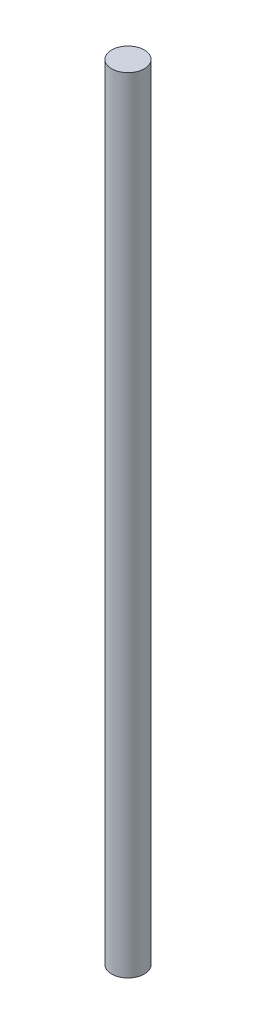
ISO-10303-21;
HEADER;
FILE_DESCRIPTION(('STEP AP214'),'2;1');
FILE_NAME('part.step','',(''),(''),'','','');
FILE_SCHEMA(('AUTOMOTIVE_DESIGN { 1 0 10303 214 1 1 1 1 }'));
ENDSEC;
DATA;
#1=APPLICATION_CONTEXT('core data for automotive mechanical design processes');
#2=APPLICATION_PROTOCOL_DEFINITION('international standard','automotive_design',2000,#1);
#3=PRODUCT_CONTEXT('',#1,'mechanical');
#4=PRODUCT('Part','Part','',(#3));
#5=PRODUCT_RELATED_PRODUCT_CATEGORY('part','',(#4));
#6=PRODUCT_DEFINITION_FORMATION('','',#4);
#7=PRODUCT_DEFINITION_CONTEXT('part definition',#1,'design');
#8=PRODUCT_DEFINITION('design','',#6,#7);
#9=PRODUCT_DEFINITION_SHAPE('','',#8);
#10=(LENGTH_UNIT() NAMED_UNIT(*) SI_UNIT(.MILLI.,.METRE.));
#11=(NAMED_UNIT(*) PLANE_ANGLE_UNIT() SI_UNIT($,.RADIAN.));
#12=(NAMED_UNIT(*) SI_UNIT($,.STERADIAN.) SOLID_ANGLE_UNIT());
#13=UNCERTAINTY_MEASURE_WITH_UNIT(LENGTH_MEASURE(1.E-05),#10,'distance_accuracy_value','');
#14=(GEOMETRIC_REPRESENTATION_CONTEXT(3) GLOBAL_UNCERTAINTY_ASSIGNED_CONTEXT((#13)) GLOBAL_UNIT_ASSIGNED_CONTEXT((#10,
#11,#12)) REPRESENTATION_CONTEXT('',''));
#15=CARTESIAN_POINT('',(0.,0.,0.));
#16=DIRECTION('',(0.,0.,1.));
#17=DIRECTION('',(1.,0.,0.));
#18=AXIS2_PLACEMENT_3D('',#15,#16,#17);
#19=CARTESIAN_POINT('',(0.,609.6,0.));
#20=DIRECTION('',(0.,-1.,0.));
#21=DIRECTION('',(0.,0.,-1.));
#22=AXIS2_PLACEMENT_3D('',#19,#20,#21);
#23=CYLINDRICAL_SURFACE('',#22,12.7);
#24=CARTESIAN_POINT('',(0.,609.6,0.));
#25=DIRECTION('',(0.,1.,0.));
#26=DIRECTION('',(0.,0.,1.));
#27=AXIS2_PLACEMENT_3D('',#24,#25,#26);
#28=CIRCLE('',#27,12.7);
#29=CARTESIAN_POINT('',(0.,609.6,12.7));
#30=VERTEX_POINT('',#29);
#31=EDGE_CURVE('E10',#30,#30,#28,.T.);
#32=ORIENTED_EDGE('',*,*,#31,.F.);
#33=EDGE_LOOP('',(#32));
#34=FACE_BOUND('',#33,.T.);
#35=CARTESIAN_POINT('',(0.,0.,0.));
#36=DIRECTION('',(0.,1.,0.));
#37=DIRECTION('',(0.,0.,1.));
#38=AXIS2_PLACEMENT_3D('',#35,#36,#37);
#39=CIRCLE('',#38,12.7);
#40=CARTESIAN_POINT('',(0.,0.,12.7));
#41=VERTEX_POINT('',#40);
#42=EDGE_CURVE('E35',#41,#41,#39,.T.);
#43=ORIENTED_EDGE('',*,*,#42,.T.);
#44=EDGE_LOOP('',(#43));
#45=FACE_BOUND('',#44,.T.);
#46=ADVANCED_FACE('F32',(#34,#45),#23,.T.);
#47=CARTESIAN_POINT('',(0.,609.6,0.));
#48=DIRECTION('',(0.,1.,0.));
#49=DIRECTION('',(0.,0.,1.));
#50=AXIS2_PLACEMENT_3D('',#47,#48,#49);
#51=PLANE('',#50);
#52=ORIENTED_EDGE('',*,*,#31,.T.);
#53=EDGE_LOOP('',(#52));
#54=FACE_BOUND('',#53,.T.);
#55=ADVANCED_FACE('F47',(#54),#51,.T.);
#56=CARTESIAN_POINT('',(0.,0.,0.));
#57=DIRECTION('',(0.,1.,0.));
#58=DIRECTION('',(0.,0.,1.));
#59=AXIS2_PLACEMENT_3D('',#56,#57,#58);
#60=PLANE('',#59);
#61=ORIENTED_EDGE('',*,*,#42,.F.);
#62=EDGE_LOOP('',(#61));
#63=FACE_BOUND('',#62,.T.);
#64=ADVANCED_FACE('F45',(#63),#60,.F.);
#65=CLOSED_SHELL('',(#46,#55,#64));
#66=MANIFOLD_SOLID_BREP('B2',#65);
#67=ADVANCED_BREP_SHAPE_REPRESENTATION('',(#18,#66),#14);
#68=SHAPE_DEFINITION_REPRESENTATION(#9,#67);
ENDSEC;
END-ISO-10303-21;
